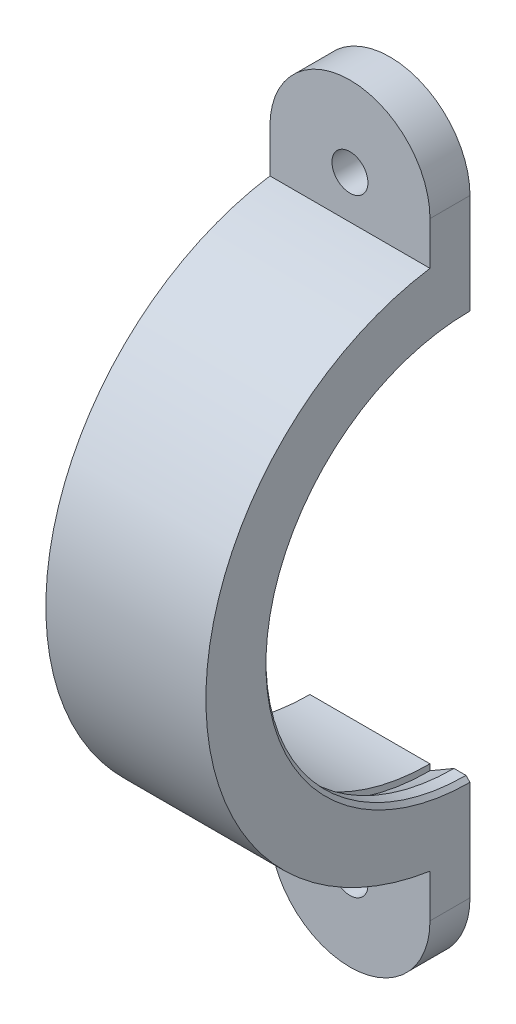
ISO-10303-21;
HEADER;
FILE_DESCRIPTION(('STEP AP214'),'2;1');
FILE_NAME('part.step','',(''),(''),'','','');
FILE_SCHEMA(('AUTOMOTIVE_DESIGN { 1 0 10303 214 1 1 1 1 }'));
ENDSEC;
DATA;
#1=APPLICATION_CONTEXT('core data for automotive mechanical design processes');
#2=APPLICATION_PROTOCOL_DEFINITION('international standard','automotive_design',2000,#1);
#3=PRODUCT_CONTEXT('',#1,'mechanical');
#4=PRODUCT('Part','Part','',(#3));
#5=PRODUCT_RELATED_PRODUCT_CATEGORY('part','',(#4));
#6=PRODUCT_DEFINITION_FORMATION('','',#4);
#7=PRODUCT_DEFINITION_CONTEXT('part definition',#1,'design');
#8=PRODUCT_DEFINITION('design','',#6,#7);
#9=PRODUCT_DEFINITION_SHAPE('','',#8);
#10=(LENGTH_UNIT() NAMED_UNIT(*) SI_UNIT(.MILLI.,.METRE.));
#11=(NAMED_UNIT(*) PLANE_ANGLE_UNIT() SI_UNIT($,.RADIAN.));
#12=(NAMED_UNIT(*) SI_UNIT($,.STERADIAN.) SOLID_ANGLE_UNIT());
#13=UNCERTAINTY_MEASURE_WITH_UNIT(LENGTH_MEASURE(1.E-05),#10,'distance_accuracy_value','');
#14=(GEOMETRIC_REPRESENTATION_CONTEXT(3) GLOBAL_UNCERTAINTY_ASSIGNED_CONTEXT((#13)) GLOBAL_UNIT_ASSIGNED_CONTEXT((#10,
#11,#12)) REPRESENTATION_CONTEXT('',''));
#15=CARTESIAN_POINT('',(0.,0.,0.));
#16=DIRECTION('',(0.,0.,1.));
#17=DIRECTION('',(1.,0.,0.));
#18=AXIS2_PLACEMENT_3D('',#15,#16,#17);
#19=CARTESIAN_POINT('',(0.,0.,0.));
#20=DIRECTION('',(-1.,0.,0.));
#21=DIRECTION('',(0.,0.,1.));
#22=AXIS2_PLACEMENT_3D('',#19,#20,#21);
#23=CYLINDRICAL_SURFACE('',#22,33.);
#24=DIRECTION('',(-1.,0.,0.));
#25=VECTOR('',#24,1.);
#26=CARTESIAN_POINT('',(0.,-32.6190128606002,4.99999999999977));
#27=LINE('',#26,#25);
#28=CARTESIAN_POINT('',(20.,-32.6190128606002,4.99999999999977));
#29=VERTEX_POINT('',#28);
#30=CARTESIAN_POINT('',(0.,-32.6190128606002,4.99999999999977));
#31=VERTEX_POINT('',#30);
#32=EDGE_CURVE('E154',#29,#31,#27,.T.);
#33=ORIENTED_EDGE('',*,*,#32,.F.);
#34=CARTESIAN_POINT('',(20.,0.,0.));
#35=DIRECTION('',(-1.,0.,0.));
#36=DIRECTION('',(0.,0.,1.));
#37=AXIS2_PLACEMENT_3D('',#34,#35,#36);
#38=CIRCLE('',#37,33.);
#39=CARTESIAN_POINT('',(20.,32.6190128606002,5.));
#40=VERTEX_POINT('',#39);
#41=EDGE_CURVE('E130',#29,#40,#38,.T.);
#42=ORIENTED_EDGE('',*,*,#41,.T.);
#43=DIRECTION('',(-1.,0.,0.));
#44=VECTOR('',#43,1.);
#45=CARTESIAN_POINT('',(0.,32.6190128606002,5.));
#46=LINE('',#45,#44);
#47=CARTESIAN_POINT('',(0.,32.6190128606002,5.));
#48=VERTEX_POINT('',#47);
#49=EDGE_CURVE('E171',#40,#48,#46,.T.);
#50=ORIENTED_EDGE('',*,*,#49,.T.);
#51=CARTESIAN_POINT('',(0.,0.,0.));
#52=DIRECTION('',(-1.,0.,0.));
#53=DIRECTION('',(0.,0.,1.));
#54=AXIS2_PLACEMENT_3D('',#51,#52,#53);
#55=CIRCLE('',#54,33.);
#56=EDGE_CURVE('E211',#31,#48,#55,.T.);
#57=ORIENTED_EDGE('',*,*,#56,.F.);
#58=EDGE_LOOP('',(#33,#42,#50,#57));
#59=FACE_BOUND('',#58,.T.);
#60=ADVANCED_FACE('F33',(#59),#23,.T.);
#61=CARTESIAN_POINT('',(15.,45.946156924622,3.20840298987752E-13));
#62=DIRECTION('',(-1.,0.,0.));
#63=DIRECTION('',(0.,0.,1.));
#64=AXIS2_PLACEMENT_3D('',#61,#62,#63);
#65=PLANE('',#64);
#66=CARTESIAN_POINT('',(15.,0.,0.));
#67=DIRECTION('',(-1.,0.,0.));
#68=DIRECTION('',(0.,0.,1.));
#69=AXIS2_PLACEMENT_3D('',#66,#67,#68);
#70=CIRCLE('',#69,26.75);
#71=CARTESIAN_POINT('',(15.,-26.75,-1.86794251628108E-13));
#72=VERTEX_POINT('',#71);
#73=CARTESIAN_POINT('',(15.,26.75,0.));
#74=VERTEX_POINT('',#73);
#75=EDGE_CURVE('E216',#72,#74,#70,.T.);
#76=ORIENTED_EDGE('',*,*,#75,.F.);
#77=DIRECTION('',(0.,-1.,0.));
#78=VECTOR('',#77,1.);
#79=CARTESIAN_POINT('',(15.,45.946156924622,3.20840298987752E-13));
#80=LINE('',#79,#78);
#81=CARTESIAN_POINT('',(15.,-26.,-1.81557029619843E-13));
#82=VERTEX_POINT('',#81);
#83=EDGE_CURVE('E191',#82,#72,#80,.T.);
#84=ORIENTED_EDGE('',*,*,#83,.F.);
#85=CARTESIAN_POINT('',(15.,0.,0.));
#86=DIRECTION('',(-1.,0.,0.));
#87=DIRECTION('',(0.,0.,1.));
#88=AXIS2_PLACEMENT_3D('',#85,#86,#87);
#89=CIRCLE('',#88,26.);
#90=CARTESIAN_POINT('',(15.,26.,0.));
#91=VERTEX_POINT('',#90);
#92=EDGE_CURVE('E206',#82,#91,#89,.T.);
#93=ORIENTED_EDGE('',*,*,#92,.T.);
#94=DIRECTION('',(0.,1.,0.));
#95=VECTOR('',#94,1.);
#96=CARTESIAN_POINT('',(15.,-45.946156924622,0.));
#97=LINE('',#96,#95);
#98=EDGE_CURVE('E176',#91,#74,#97,.T.);
#99=ORIENTED_EDGE('',*,*,#98,.T.);
#100=EDGE_LOOP('',(#76,#84,#93,#99));
#101=FACE_BOUND('',#100,.T.);
#102=ADVANCED_FACE('F258',(#101),#65,.F.);
#103=CARTESIAN_POINT('',(15.,0.,0.));
#104=DIRECTION('',(-1.,0.,0.));
#105=DIRECTION('',(0.,0.,1.));
#106=AXIS2_PLACEMENT_3D('',#103,#104,#105);
#107=CONICAL_SURFACE('',#106,26.75,0.528074448426364);
#108=CARTESIAN_POINT('',(18.,0.,0.));
#109=DIRECTION('',(-1.,0.,0.));
#110=DIRECTION('',(0.,0.,1.));
#111=AXIS2_PLACEMENT_3D('',#108,#109,#110);
#112=CIRCLE('',#111,25.);
#113=CARTESIAN_POINT('',(18.,-25.,-1.74574066942157E-13));
#114=VERTEX_POINT('',#113);
#115=CARTESIAN_POINT('',(18.,25.,0.));
#116=VERTEX_POINT('',#115);
#117=EDGE_CURVE('E214',#114,#116,#112,.T.);
#118=ORIENTED_EDGE('',*,*,#117,.F.);
#119=DIRECTION('',(0.863778900898433,0.503871025524087,0.));
#120=VECTOR('',#119,1.);
#121=CARTESIAN_POINT('',(51.0635481913489,-5.71293022171306,0.));
#122=LINE('',#121,#120);
#123=EDGE_CURVE('E194',#72,#114,#122,.T.);
#124=ORIENTED_EDGE('',*,*,#123,.F.);
#125=ORIENTED_EDGE('',*,*,#75,.T.);
#126=DIRECTION('',(0.863778900898433,-0.503871025524087,0.));
#127=VECTOR('',#126,1.);
#128=CARTESIAN_POINT('',(51.0635481913489,5.71293022171306,0.));
#129=LINE('',#128,#127);
#130=EDGE_CURVE('E179',#74,#116,#129,.T.);
#131=ORIENTED_EDGE('',*,*,#130,.T.);
#132=EDGE_LOOP('',(#118,#124,#125,#131));
#133=FACE_BOUND('',#132,.T.);
#134=ADVANCED_FACE('F263',(#133),#107,.F.);
#135=CARTESIAN_POINT('',(0.,0.,0.));
#136=DIRECTION('',(-1.,0.,0.));
#137=DIRECTION('',(0.,0.,1.));
#138=AXIS2_PLACEMENT_3D('',#135,#136,#137);
#139=CYLINDRICAL_SURFACE('',#138,25.);
#140=DIRECTION('',(1.,0.,0.));
#141=VECTOR('',#140,1.);
#142=CARTESIAN_POINT('',(20.9290806893201,25.,0.));
#143=LINE('',#142,#141);
#144=CARTESIAN_POINT('',(19.5,25.,0.));
#145=VERTEX_POINT('',#144);
#146=EDGE_CURVE('E182',#116,#145,#143,.T.);
#147=ORIENTED_EDGE('',*,*,#146,.T.);
#148=CARTESIAN_POINT('',(19.5,0.,0.));
#149=DIRECTION('',(1.,0.,0.));
#150=DIRECTION('',(0.,0.,-1.));
#151=AXIS2_PLACEMENT_3D('',#148,#149,#150);
#152=CIRCLE('',#151,25.);
#153=CARTESIAN_POINT('',(19.5,-25.,-1.74574066942157E-13));
#154=VERTEX_POINT('',#153);
#155=EDGE_CURVE('E41',#145,#154,#152,.T.);
#156=ORIENTED_EDGE('',*,*,#155,.T.);
#157=DIRECTION('',(1.,0.,0.));
#158=VECTOR('',#157,1.);
#159=CARTESIAN_POINT('',(20.9290806893201,-25.,-1.74574066942157E-13));
#160=LINE('',#159,#158);
#161=EDGE_CURVE('E197',#114,#154,#160,.T.);
#162=ORIENTED_EDGE('',*,*,#161,.F.);
#163=ORIENTED_EDGE('',*,*,#117,.T.);
#164=EDGE_LOOP('',(#147,#156,#162,#163));
#165=FACE_BOUND('',#164,.T.);
#166=ADVANCED_FACE('F271',(#165),#139,.F.);
#167=CARTESIAN_POINT('',(20.,45.946156924622,3.20840298987752E-13));
#168=DIRECTION('',(1.,0.,0.));
#169=DIRECTION('',(0.,0.,-1.));
#170=AXIS2_PLACEMENT_3D('',#167,#168,#169);
#171=PLANE('',#170);
#172=DIRECTION('',(0.,1.,0.));
#173=VECTOR('',#172,1.);
#174=CARTESIAN_POINT('',(20.,45.946156924622,3.20840298987752E-13));
#175=LINE('',#174,#173);
#176=CARTESIAN_POINT('',(20.,-38.,-2.65352581752078E-13));
#177=VERTEX_POINT('',#176);
#178=CARTESIAN_POINT('',(20.,-25.5,-1.78065548281E-13));
#179=VERTEX_POINT('',#178);
#180=EDGE_CURVE('E199',#177,#179,#175,.T.);
#181=ORIENTED_EDGE('',*,*,#180,.T.);
#182=CARTESIAN_POINT('',(20.,0.,0.));
#183=DIRECTION('',(1.,0.,0.));
#184=DIRECTION('',(0.,0.,-1.));
#185=AXIS2_PLACEMENT_3D('',#182,#183,#184);
#186=CIRCLE('',#185,25.5);
#187=CARTESIAN_POINT('',(20.,25.5,0.));
#188=VERTEX_POINT('',#187);
#189=EDGE_CURVE('E218',#179,#188,#186,.F.);
#190=ORIENTED_EDGE('',*,*,#189,.T.);
#191=DIRECTION('',(0.,-1.,0.));
#192=VECTOR('',#191,1.);
#193=CARTESIAN_POINT('',(20.,-45.946156924622,0.));
#194=LINE('',#193,#192);
#195=CARTESIAN_POINT('',(20.,38.,0.));
#196=VERTEX_POINT('',#195);
#197=EDGE_CURVE('E184',#196,#188,#194,.T.);
#198=ORIENTED_EDGE('',*,*,#197,.F.);
#199=DIRECTION('',(0.,0.,-1.));
#200=VECTOR('',#199,1.);
#201=CARTESIAN_POINT('',(20.,38.,5.));
#202=LINE('',#201,#200);
#203=CARTESIAN_POINT('',(20.,38.,5.));
#204=VERTEX_POINT('',#203);
#205=EDGE_CURVE('E168',#204,#196,#202,.T.);
#206=ORIENTED_EDGE('',*,*,#205,.F.);
#207=DIRECTION('',(0.,-1.,0.));
#208=VECTOR('',#207,1.);
#209=CARTESIAN_POINT('',(20.,29.,5.));
#210=LINE('',#209,#208);
#211=EDGE_CURVE('E158',#204,#40,#210,.T.);
#212=ORIENTED_EDGE('',*,*,#211,.T.);
#213=ORIENTED_EDGE('',*,*,#41,.F.);
#214=DIRECTION('',(0.,-1.,0.));
#215=VECTOR('',#214,1.);
#216=CARTESIAN_POINT('',(20.,-29.,4.9999999999998));
#217=LINE('',#216,#215);
#218=CARTESIAN_POINT('',(20.,-38.,4.99999999999973));
#219=VERTEX_POINT('',#218);
#220=EDGE_CURVE('E123',#29,#219,#217,.T.);
#221=ORIENTED_EDGE('',*,*,#220,.T.);
#222=DIRECTION('',(0.,0.,-1.));
#223=VECTOR('',#222,1.);
#224=CARTESIAN_POINT('',(20.,-38.,4.99999999999973));
#225=LINE('',#224,#223);
#226=EDGE_CURVE('E127',#219,#177,#225,.T.);
#227=ORIENTED_EDGE('',*,*,#226,.T.);
#228=EDGE_LOOP('',(#181,#190,#198,#206,#212,#213,#221,#227));
#229=FACE_BOUND('',#228,.T.);
#230=ADVANCED_FACE('F126',(#229),#171,.T.);
#231=CARTESIAN_POINT('',(0.,45.946156924622,3.20840298987752E-13));
#232=DIRECTION('',(1.,0.,0.));
#233=DIRECTION('',(0.,0.,-1.));
#234=AXIS2_PLACEMENT_3D('',#231,#232,#233);
#235=PLANE('',#234);
#236=CARTESIAN_POINT('',(0.,0.,0.));
#237=DIRECTION('',(-1.,0.,0.));
#238=DIRECTION('',(0.,0.,1.));
#239=AXIS2_PLACEMENT_3D('',#236,#237,#238);
#240=CIRCLE('',#239,26.);
#241=CARTESIAN_POINT('',(0.,-26.,-1.81557029619843E-13));
#242=VERTEX_POINT('',#241);
#243=CARTESIAN_POINT('',(0.,26.,0.));
#244=VERTEX_POINT('',#243);
#245=EDGE_CURVE('E208',#242,#244,#240,.T.);
#246=ORIENTED_EDGE('',*,*,#245,.F.);
#247=DIRECTION('',(0.,1.,0.));
#248=VECTOR('',#247,1.);
#249=CARTESIAN_POINT('',(0.,45.946156924622,3.20840298987752E-13));
#250=LINE('',#249,#248);
#251=CARTESIAN_POINT('',(0.,-38.,-2.65352581752078E-13));
#252=VERTEX_POINT('',#251);
#253=EDGE_CURVE('E201',#252,#242,#250,.T.);
#254=ORIENTED_EDGE('',*,*,#253,.F.);
#255=DIRECTION('',(0.,0.,-1.));
#256=VECTOR('',#255,1.);
#257=CARTESIAN_POINT('',(0.,-38.,4.99999999999973));
#258=LINE('',#257,#256);
#259=CARTESIAN_POINT('',(0.,-38.,4.99999999999973));
#260=VERTEX_POINT('',#259);
#261=EDGE_CURVE('E142',#260,#252,#258,.T.);
#262=ORIENTED_EDGE('',*,*,#261,.F.);
#263=DIRECTION('',(0.,1.,0.));
#264=VECTOR('',#263,1.);
#265=CARTESIAN_POINT('',(0.,-29.,4.9999999999998));
#266=LINE('',#265,#264);
#267=EDGE_CURVE('E143',#260,#31,#266,.T.);
#268=ORIENTED_EDGE('',*,*,#267,.T.);
#269=ORIENTED_EDGE('',*,*,#56,.T.);
#270=DIRECTION('',(0.,1.,0.));
#271=VECTOR('',#270,1.);
#272=CARTESIAN_POINT('',(0.,29.,5.));
#273=LINE('',#272,#271);
#274=CARTESIAN_POINT('',(0.,38.,5.));
#275=VERTEX_POINT('',#274);
#276=EDGE_CURVE('E160',#48,#275,#273,.T.);
#277=ORIENTED_EDGE('',*,*,#276,.T.);
#278=DIRECTION('',(0.,0.,-1.));
#279=VECTOR('',#278,1.);
#280=CARTESIAN_POINT('',(0.,38.,5.));
#281=LINE('',#280,#279);
#282=CARTESIAN_POINT('',(0.,38.,0.));
#283=VERTEX_POINT('',#282);
#284=EDGE_CURVE('E165',#275,#283,#281,.T.);
#285=ORIENTED_EDGE('',*,*,#284,.T.);
#286=DIRECTION('',(0.,-1.,0.));
#287=VECTOR('',#286,1.);
#288=CARTESIAN_POINT('',(0.,-45.946156924622,0.));
#289=LINE('',#288,#287);
#290=EDGE_CURVE('E186',#283,#244,#289,.T.);
#291=ORIENTED_EDGE('',*,*,#290,.T.);
#292=EDGE_LOOP('',(#246,#254,#262,#268,#269,#277,#285,#291));
#293=FACE_BOUND('',#292,.T.);
#294=ADVANCED_FACE('F246',(#293),#235,.F.);
#295=CARTESIAN_POINT('',(0.,0.,0.));
#296=DIRECTION('',(-1.,0.,0.));
#297=DIRECTION('',(0.,0.,1.));
#298=AXIS2_PLACEMENT_3D('',#295,#296,#297);
#299=CYLINDRICAL_SURFACE('',#298,26.);
#300=DIRECTION('',(1.,0.,0.));
#301=VECTOR('',#300,1.);
#302=CARTESIAN_POINT('',(20.9290806893201,-26.,-1.81557029619843E-13));
#303=LINE('',#302,#301);
#304=EDGE_CURVE('E203',#242,#82,#303,.T.);
#305=ORIENTED_EDGE('',*,*,#304,.F.);
#306=ORIENTED_EDGE('',*,*,#245,.T.);
#307=DIRECTION('',(1.,0.,0.));
#308=VECTOR('',#307,1.);
#309=CARTESIAN_POINT('',(20.9290806893201,26.,0.));
#310=LINE('',#309,#308);
#311=EDGE_CURVE('E188',#244,#91,#310,.T.);
#312=ORIENTED_EDGE('',*,*,#311,.T.);
#313=ORIENTED_EDGE('',*,*,#92,.F.);
#314=EDGE_LOOP('',(#305,#306,#312,#313));
#315=FACE_BOUND('',#314,.T.);
#316=ADVANCED_FACE('F283',(#315),#299,.F.);
#317=CARTESIAN_POINT('',(20.9290806893201,45.946156924622,3.20840298987752E-13));
#318=DIRECTION('',(0.,0.,-1.));
#319=DIRECTION('',(1.,0.,0.));
#320=AXIS2_PLACEMENT_3D('',#317,#318,#319);
#321=PLANE('',#320);
#322=CARTESIAN_POINT('',(10.,-38.,0.));
#323=DIRECTION('',(0.,0.,-1.));
#324=DIRECTION('',(-1.,0.,0.));
#325=AXIS2_PLACEMENT_3D('',#322,#323,#324);
#326=CIRCLE('',#325,2.2479);
#327=CARTESIAN_POINT('',(7.7521,-38.,0.));
#328=VERTEX_POINT('',#327);
#329=EDGE_CURVE('E225',#328,#328,#326,.T.);
#330=ORIENTED_EDGE('',*,*,#329,.F.);
#331=EDGE_LOOP('',(#330));
#332=FACE_BOUND('',#331,.T.);
#333=ORIENTED_EDGE('',*,*,#161,.T.);
#334=DIRECTION('',(-0.70710678118655,0.707106781186545,0.));
#335=VECTOR('',#334,1.);
#336=CARTESIAN_POINT('',(-5.50000000000016,0.,0.));
#337=LINE('',#336,#335);
#338=EDGE_CURVE('E11',#154,#179,#337,.F.);
#339=ORIENTED_EDGE('',*,*,#338,.T.);
#340=ORIENTED_EDGE('',*,*,#180,.F.);
#341=CARTESIAN_POINT('',(10.,-38.,-2.65352581752078E-13));
#342=DIRECTION('',(0.,0.,-1.));
#343=DIRECTION('',(0.,-1.,0.));
#344=AXIS2_PLACEMENT_3D('',#341,#342,#343);
#345=CIRCLE('',#344,10.);
#346=EDGE_CURVE('E135',#177,#252,#345,.T.);
#347=ORIENTED_EDGE('',*,*,#346,.T.);
#348=ORIENTED_EDGE('',*,*,#253,.T.);
#349=ORIENTED_EDGE('',*,*,#304,.T.);
#350=ORIENTED_EDGE('',*,*,#83,.T.);
#351=ORIENTED_EDGE('',*,*,#123,.T.);
#352=EDGE_LOOP('',(#333,#339,#340,#347,#348,#349,#350,#351));
#353=FACE_BOUND('',#352,.T.);
#354=ADVANCED_FACE('F248',(#332,#353),#321,.T.);
#355=CARTESIAN_POINT('',(20.9290806893201,-45.946156924622,0.));
#356=DIRECTION('',(0.,0.,1.));
#357=DIRECTION('',(1.,0.,0.));
#358=AXIS2_PLACEMENT_3D('',#355,#356,#357);
#359=PLANE('',#358);
#360=CARTESIAN_POINT('',(10.,38.,0.));
#361=DIRECTION('',(0.,0.,-1.));
#362=DIRECTION('',(-1.,0.,0.));
#363=AXIS2_PLACEMENT_3D('',#360,#361,#362);
#364=CIRCLE('',#363,2.2479);
#365=CARTESIAN_POINT('',(7.7521,38.,0.));
#366=VERTEX_POINT('',#365);
#367=EDGE_CURVE('E221',#366,#366,#364,.T.);
#368=ORIENTED_EDGE('',*,*,#367,.F.);
#369=EDGE_LOOP('',(#368));
#370=FACE_BOUND('',#369,.T.);
#371=ORIENTED_EDGE('',*,*,#197,.T.);
#372=DIRECTION('',(-0.70710678118655,-0.707106781186545,0.));
#373=VECTOR('',#372,1.);
#374=CARTESIAN_POINT('',(-5.50000000000016,0.,0.));
#375=LINE('',#374,#373);
#376=EDGE_CURVE('E55',#188,#145,#375,.T.);
#377=ORIENTED_EDGE('',*,*,#376,.T.);
#378=ORIENTED_EDGE('',*,*,#146,.F.);
#379=ORIENTED_EDGE('',*,*,#130,.F.);
#380=ORIENTED_EDGE('',*,*,#98,.F.);
#381=ORIENTED_EDGE('',*,*,#311,.F.);
#382=ORIENTED_EDGE('',*,*,#290,.F.);
#383=CARTESIAN_POINT('',(10.,38.,0.));
#384=DIRECTION('',(0.,0.,-1.));
#385=DIRECTION('',(-1.,0.,0.));
#386=AXIS2_PLACEMENT_3D('',#383,#384,#385);
#387=CIRCLE('',#386,10.);
#388=EDGE_CURVE('E157',#283,#196,#387,.T.);
#389=ORIENTED_EDGE('',*,*,#388,.T.);
#390=EDGE_LOOP('',(#371,#377,#378,#379,#380,#381,#382,#389));
#391=FACE_BOUND('',#390,.T.);
#392=ADVANCED_FACE('F231',(#370,#391),#359,.F.);
#393=CARTESIAN_POINT('',(10.,38.,5.));
#394=DIRECTION('',(0.,0.,-1.));
#395=DIRECTION('',(-1.,0.,0.));
#396=AXIS2_PLACEMENT_3D('',#393,#394,#395);
#397=CYLINDRICAL_SURFACE('',#396,10.);
#398=ORIENTED_EDGE('',*,*,#388,.F.);
#399=ORIENTED_EDGE('',*,*,#284,.F.);
#400=CARTESIAN_POINT('',(10.,38.,5.));
#401=DIRECTION('',(0.,0.,-1.));
#402=DIRECTION('',(-1.,0.,0.));
#403=AXIS2_PLACEMENT_3D('',#400,#401,#402);
#404=CIRCLE('',#403,10.);
#405=EDGE_CURVE('E162',#275,#204,#404,.T.);
#406=ORIENTED_EDGE('',*,*,#405,.T.);
#407=ORIENTED_EDGE('',*,*,#205,.T.);
#408=EDGE_LOOP('',(#398,#399,#406,#407));
#409=FACE_BOUND('',#408,.T.);
#410=ADVANCED_FACE('F236',(#409),#397,.T.);
#411=CARTESIAN_POINT('',(10.,38.,5.));
#412=DIRECTION('',(0.,0.,-1.));
#413=DIRECTION('',(-1.,0.,0.));
#414=AXIS2_PLACEMENT_3D('',#411,#412,#413);
#415=PLANE('',#414);
#416=CARTESIAN_POINT('',(10.,38.,5.));
#417=DIRECTION('',(0.,0.,-1.));
#418=DIRECTION('',(-1.,0.,0.));
#419=AXIS2_PLACEMENT_3D('',#416,#417,#418);
#420=CIRCLE('',#419,2.2479);
#421=CARTESIAN_POINT('',(7.7521,38.,5.));
#422=VERTEX_POINT('',#421);
#423=EDGE_CURVE('E153',#422,#422,#420,.T.);
#424=ORIENTED_EDGE('',*,*,#423,.T.);
#425=EDGE_LOOP('',(#424));
#426=FACE_BOUND('',#425,.T.);
#427=ORIENTED_EDGE('',*,*,#49,.F.);
#428=ORIENTED_EDGE('',*,*,#211,.F.);
#429=ORIENTED_EDGE('',*,*,#405,.F.);
#430=ORIENTED_EDGE('',*,*,#276,.F.);
#431=EDGE_LOOP('',(#427,#428,#429,#430));
#432=FACE_BOUND('',#431,.T.);
#433=ADVANCED_FACE('F241',(#426,#432),#415,.F.);
#434=CARTESIAN_POINT('',(10.,-38.,4.99999999999973));
#435=DIRECTION('',(0.,0.,-1.));
#436=DIRECTION('',(0.,1.,0.));
#437=AXIS2_PLACEMENT_3D('',#434,#435,#436);
#438=CYLINDRICAL_SURFACE('',#437,10.);
#439=ORIENTED_EDGE('',*,*,#346,.F.);
#440=ORIENTED_EDGE('',*,*,#226,.F.);
#441=CARTESIAN_POINT('',(10.,-38.,4.99999999999973));
#442=DIRECTION('',(0.,0.,-1.));
#443=DIRECTION('',(0.,-1.,0.));
#444=AXIS2_PLACEMENT_3D('',#441,#442,#443);
#445=CIRCLE('',#444,10.);
#446=EDGE_CURVE('E134',#219,#260,#445,.T.);
#447=ORIENTED_EDGE('',*,*,#446,.T.);
#448=ORIENTED_EDGE('',*,*,#261,.T.);
#449=EDGE_LOOP('',(#439,#440,#447,#448));
#450=FACE_BOUND('',#449,.T.);
#451=ADVANCED_FACE('F139',(#450),#438,.T.);
#452=CARTESIAN_POINT('',(10.,-38.,4.99999999999973));
#453=DIRECTION('',(0.,0.,1.));
#454=DIRECTION('',(0.,-1.,0.));
#455=AXIS2_PLACEMENT_3D('',#452,#453,#454);
#456=PLANE('',#455);
#457=CARTESIAN_POINT('',(10.,-38.,4.99999999999973));
#458=DIRECTION('',(0.,0.,1.));
#459=DIRECTION('',(0.,-1.,0.));
#460=AXIS2_PLACEMENT_3D('',#457,#458,#459);
#461=CIRCLE('',#460,2.2479);
#462=CARTESIAN_POINT('',(10.,-40.2479,4.99999999999972));
#463=VERTEX_POINT('',#462);
#464=EDGE_CURVE('E222',#463,#463,#461,.T.);
#465=ORIENTED_EDGE('',*,*,#464,.F.);
#466=EDGE_LOOP('',(#465));
#467=FACE_BOUND('',#466,.T.);
#468=ORIENTED_EDGE('',*,*,#220,.F.);
#469=ORIENTED_EDGE('',*,*,#32,.T.);
#470=ORIENTED_EDGE('',*,*,#267,.F.);
#471=ORIENTED_EDGE('',*,*,#446,.F.);
#472=EDGE_LOOP('',(#468,#469,#470,#471));
#473=FACE_BOUND('',#472,.T.);
#474=ADVANCED_FACE('F146',(#467,#473),#456,.T.);
#475=CARTESIAN_POINT('',(10.,38.,33.));
#476=DIRECTION('',(0.,0.,-1.));
#477=DIRECTION('',(-1.,0.,0.));
#478=AXIS2_PLACEMENT_3D('',#475,#476,#477);
#479=CYLINDRICAL_SURFACE('',#478,2.2479);
#480=ORIENTED_EDGE('',*,*,#367,.T.);
#481=EDGE_LOOP('',(#480));
#482=FACE_BOUND('',#481,.T.);
#483=ORIENTED_EDGE('',*,*,#423,.F.);
#484=EDGE_LOOP('',(#483));
#485=FACE_BOUND('',#484,.T.);
#486=ADVANCED_FACE('F254',(#482,#485),#479,.F.);
#487=CARTESIAN_POINT('',(10.,-38.,33.));
#488=DIRECTION('',(0.,0.,-1.));
#489=DIRECTION('',(-1.,0.,0.));
#490=AXIS2_PLACEMENT_3D('',#487,#488,#489);
#491=CYLINDRICAL_SURFACE('',#490,2.2479);
#492=ORIENTED_EDGE('',*,*,#464,.T.);
#493=EDGE_LOOP('',(#492));
#494=FACE_BOUND('',#493,.T.);
#495=ORIENTED_EDGE('',*,*,#329,.T.);
#496=EDGE_LOOP('',(#495));
#497=FACE_BOUND('',#496,.T.);
#498=ADVANCED_FACE('F250',(#494,#497),#491,.F.);
#499=CARTESIAN_POINT('',(20.,0.,0.));
#500=DIRECTION('',(1.,0.,0.));
#501=DIRECTION('',(0.,0.,-1.));
#502=AXIS2_PLACEMENT_3D('',#499,#500,#501);
#503=CONICAL_SURFACE('',#502,25.5,0.785398163397445);
#504=ORIENTED_EDGE('',*,*,#338,.F.);
#505=ORIENTED_EDGE('',*,*,#155,.F.);
#506=ORIENTED_EDGE('',*,*,#376,.F.);
#507=ORIENTED_EDGE('',*,*,#189,.F.);
#508=EDGE_LOOP('',(#504,#505,#506,#507));
#509=FACE_BOUND('',#508,.T.);
#510=ADVANCED_FACE('F35',(#509),#503,.F.);
#511=CLOSED_SHELL('',(#60,#102,#134,#166,#230,#294,#316,#354,#392,#410,#433,#451,#474,#486,#498,#510));
#512=MANIFOLD_SOLID_BREP('B2',#511);
#513=ADVANCED_BREP_SHAPE_REPRESENTATION('',(#18,#512),#14);
#514=SHAPE_DEFINITION_REPRESENTATION(#9,#513);
ENDSEC;
END-ISO-10303-21;
